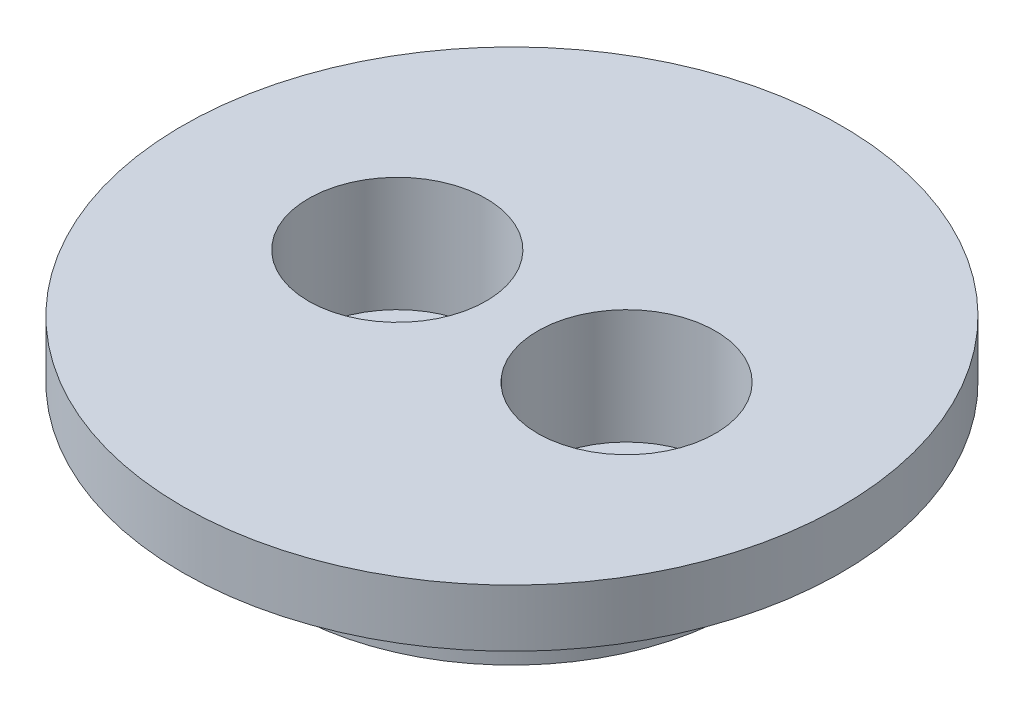
ISO-10303-21;
HEADER;
FILE_DESCRIPTION(('STEP AP214'),'2;1');
FILE_NAME('part.step','',(''),(''),'','','');
FILE_SCHEMA(('AUTOMOTIVE_DESIGN { 1 0 10303 214 1 1 1 1 }'));
ENDSEC;
DATA;
#1=APPLICATION_CONTEXT('core data for automotive mechanical design processes');
#2=APPLICATION_PROTOCOL_DEFINITION('international standard','automotive_design',2000,#1);
#3=PRODUCT_CONTEXT('',#1,'mechanical');
#4=PRODUCT('Part','Part','',(#3));
#5=PRODUCT_RELATED_PRODUCT_CATEGORY('part','',(#4));
#6=PRODUCT_DEFINITION_FORMATION('','',#4);
#7=PRODUCT_DEFINITION_CONTEXT('part definition',#1,'design');
#8=PRODUCT_DEFINITION('design','',#6,#7);
#9=PRODUCT_DEFINITION_SHAPE('','',#8);
#10=(LENGTH_UNIT() NAMED_UNIT(*) SI_UNIT(.MILLI.,.METRE.));
#11=(NAMED_UNIT(*) PLANE_ANGLE_UNIT() SI_UNIT($,.RADIAN.));
#12=(NAMED_UNIT(*) SI_UNIT($,.STERADIAN.) SOLID_ANGLE_UNIT());
#13=UNCERTAINTY_MEASURE_WITH_UNIT(LENGTH_MEASURE(1.E-05),#10,'distance_accuracy_value','');
#14=(GEOMETRIC_REPRESENTATION_CONTEXT(3) GLOBAL_UNCERTAINTY_ASSIGNED_CONTEXT((#13)) GLOBAL_UNIT_ASSIGNED_CONTEXT((#10,
#11,#12)) REPRESENTATION_CONTEXT('',''));
#15=CARTESIAN_POINT('',(0.,0.,0.));
#16=DIRECTION('',(0.,0.,1.));
#17=DIRECTION('',(1.,0.,0.));
#18=AXIS2_PLACEMENT_3D('',#15,#16,#17);
#19=CARTESIAN_POINT('',(-4.,38.,0.));
#20=DIRECTION('',(0.,-1.,0.));
#21=DIRECTION('',(0.,0.,-1.));
#22=AXIS2_PLACEMENT_3D('',#19,#20,#21);
#23=CYLINDRICAL_SURFACE('',#22,1.5);
#24=CARTESIAN_POINT('',(-4.,35.,0.));
#25=DIRECTION('',(0.,1.,0.));
#26=DIRECTION('',(0.,0.,1.));
#27=AXIS2_PLACEMENT_3D('',#24,#25,#26);
#28=CIRCLE('',#27,1.5);
#29=CARTESIAN_POINT('',(-4.,35.,1.5));
#30=VERTEX_POINT('',#29);
#31=EDGE_CURVE('E43',#30,#30,#28,.T.);
#32=ORIENTED_EDGE('',*,*,#31,.F.);
#33=EDGE_LOOP('',(#32));
#34=FACE_BOUND('',#33,.T.);
#35=CARTESIAN_POINT('',(-4.,36.,0.));
#36=DIRECTION('',(0.,1.,0.));
#37=DIRECTION('',(0.,0.,1.));
#38=AXIS2_PLACEMENT_3D('',#35,#36,#37);
#39=CIRCLE('',#38,1.5);
#40=CARTESIAN_POINT('',(-4.,36.,1.5));
#41=VERTEX_POINT('',#40);
#42=EDGE_CURVE('E34',#41,#41,#39,.T.);
#43=ORIENTED_EDGE('',*,*,#42,.T.);
#44=EDGE_LOOP('',(#43));
#45=FACE_BOUND('',#44,.T.);
#46=ADVANCED_FACE('F30',(#34,#45),#23,.F.);
#47=CARTESIAN_POINT('',(4.,38.,0.));
#48=DIRECTION('',(0.,-1.,0.));
#49=DIRECTION('',(0.,0.,-1.));
#50=AXIS2_PLACEMENT_3D('',#47,#48,#49);
#51=CYLINDRICAL_SURFACE('',#50,1.5);
#52=CARTESIAN_POINT('',(4.,35.,0.));
#53=DIRECTION('',(0.,1.,0.));
#54=DIRECTION('',(0.,0.,1.));
#55=AXIS2_PLACEMENT_3D('',#52,#53,#54);
#56=CIRCLE('',#55,1.5);
#57=CARTESIAN_POINT('',(4.,35.,1.5));
#58=VERTEX_POINT('',#57);
#59=EDGE_CURVE('E71',#58,#58,#56,.T.);
#60=ORIENTED_EDGE('',*,*,#59,.F.);
#61=EDGE_LOOP('',(#60));
#62=FACE_BOUND('',#61,.T.);
#63=CARTESIAN_POINT('',(4.,36.,0.));
#64=DIRECTION('',(0.,1.,0.));
#65=DIRECTION('',(0.,0.,1.));
#66=AXIS2_PLACEMENT_3D('',#63,#64,#65);
#67=CIRCLE('',#66,1.5);
#68=CARTESIAN_POINT('',(4.,36.,1.5));
#69=VERTEX_POINT('',#68);
#70=EDGE_CURVE('E47',#69,#69,#67,.T.);
#71=ORIENTED_EDGE('',*,*,#70,.T.);
#72=EDGE_LOOP('',(#71));
#73=FACE_BOUND('',#72,.T.);
#74=ADVANCED_FACE('F83',(#62,#73),#51,.F.);
#75=CARTESIAN_POINT('',(0.,35.,0.));
#76=DIRECTION('',(0.,1.,0.));
#77=DIRECTION('',(0.,0.,1.));
#78=AXIS2_PLACEMENT_3D('',#75,#76,#77);
#79=PLANE('',#78);
#80=CARTESIAN_POINT('',(0.,35.,0.));
#81=DIRECTION('',(0.,1.,0.));
#82=DIRECTION('',(0.,0.,1.));
#83=AXIS2_PLACEMENT_3D('',#80,#81,#82);
#84=CIRCLE('',#83,7.85);
#85=CARTESIAN_POINT('',(0.,35.,7.85));
#86=VERTEX_POINT('',#85);
#87=EDGE_CURVE('E38',#86,#86,#84,.T.);
#88=ORIENTED_EDGE('',*,*,#87,.F.);
#89=EDGE_LOOP('',(#88));
#90=FACE_BOUND('',#89,.T.);
#91=ORIENTED_EDGE('',*,*,#31,.T.);
#92=EDGE_LOOP('',(#91));
#93=FACE_BOUND('',#92,.T.);
#94=ORIENTED_EDGE('',*,*,#59,.T.);
#95=EDGE_LOOP('',(#94));
#96=FACE_BOUND('',#95,.T.);
#97=ADVANCED_FACE('F79',(#90,#93,#96),#79,.F.);
#98=CARTESIAN_POINT('',(0.,38.,0.));
#99=DIRECTION('',(0.,-1.,0.));
#100=DIRECTION('',(0.,0.,-1.));
#101=AXIS2_PLACEMENT_3D('',#98,#99,#100);
#102=CYLINDRICAL_SURFACE('',#101,7.85);
#103=CARTESIAN_POINT('',(0.,38.,0.));
#104=DIRECTION('',(0.,1.,0.));
#105=DIRECTION('',(0.,0.,1.));
#106=AXIS2_PLACEMENT_3D('',#103,#104,#105);
#107=CIRCLE('',#106,7.85);
#108=CARTESIAN_POINT('',(0.,38.,7.85));
#109=VERTEX_POINT('',#108);
#110=EDGE_CURVE('E10',#109,#109,#107,.T.);
#111=ORIENTED_EDGE('',*,*,#110,.F.);
#112=EDGE_LOOP('',(#111));
#113=FACE_BOUND('',#112,.T.);
#114=ORIENTED_EDGE('',*,*,#87,.T.);
#115=EDGE_LOOP('',(#114));
#116=FACE_BOUND('',#115,.T.);
#117=ADVANCED_FACE('F32',(#113,#116),#102,.T.);
#118=CARTESIAN_POINT('',(0.,40.,0.));
#119=DIRECTION('',(0.,1.,0.));
#120=DIRECTION('',(0.,0.,1.));
#121=AXIS2_PLACEMENT_3D('',#118,#119,#120);
#122=PLANE('',#121);
#123=CARTESIAN_POINT('',(-4.,40.,0.));
#124=DIRECTION('',(0.,1.,0.));
#125=DIRECTION('',(0.,0.,1.));
#126=AXIS2_PLACEMENT_3D('',#123,#124,#125);
#127=CIRCLE('',#126,3.1);
#128=CARTESIAN_POINT('',(-4.,40.,3.1));
#129=VERTEX_POINT('',#128);
#130=EDGE_CURVE('E55',#129,#129,#127,.T.);
#131=ORIENTED_EDGE('',*,*,#130,.F.);
#132=EDGE_LOOP('',(#131));
#133=FACE_BOUND('',#132,.T.);
#134=CARTESIAN_POINT('',(4.,40.,0.));
#135=DIRECTION('',(0.,1.,0.));
#136=DIRECTION('',(0.,0.,1.));
#137=AXIS2_PLACEMENT_3D('',#134,#135,#136);
#138=CIRCLE('',#137,3.1);
#139=CARTESIAN_POINT('',(4.,40.,3.1));
#140=VERTEX_POINT('',#139);
#141=EDGE_CURVE('E65',#140,#140,#138,.T.);
#142=ORIENTED_EDGE('',*,*,#141,.F.);
#143=EDGE_LOOP('',(#142));
#144=FACE_BOUND('',#143,.T.);
#145=CARTESIAN_POINT('',(0.,40.,0.));
#146=DIRECTION('',(0.,1.,0.));
#147=DIRECTION('',(0.,0.,1.));
#148=AXIS2_PLACEMENT_3D('',#145,#146,#147);
#149=CIRCLE('',#148,11.5);
#150=CARTESIAN_POINT('',(0.,40.,11.5));
#151=VERTEX_POINT('',#150);
#152=EDGE_CURVE('E68',#151,#151,#149,.T.);
#153=ORIENTED_EDGE('',*,*,#152,.T.);
#154=EDGE_LOOP('',(#153));
#155=FACE_BOUND('',#154,.T.);
#156=ADVANCED_FACE('F106',(#133,#144,#155),#122,.T.);
#157=CARTESIAN_POINT('',(0.,38.,0.));
#158=DIRECTION('',(0.,1.,0.));
#159=DIRECTION('',(0.,0.,1.));
#160=AXIS2_PLACEMENT_3D('',#157,#158,#159);
#161=PLANE('',#160);
#162=ORIENTED_EDGE('',*,*,#110,.T.);
#163=EDGE_LOOP('',(#162));
#164=FACE_BOUND('',#163,.T.);
#165=CARTESIAN_POINT('',(0.,38.,0.));
#166=DIRECTION('',(0.,1.,0.));
#167=DIRECTION('',(0.,0.,1.));
#168=AXIS2_PLACEMENT_3D('',#165,#166,#167);
#169=CIRCLE('',#168,11.5);
#170=CARTESIAN_POINT('',(0.,38.,11.5));
#171=VERTEX_POINT('',#170);
#172=EDGE_CURVE('E53',#171,#171,#169,.T.);
#173=ORIENTED_EDGE('',*,*,#172,.F.);
#174=EDGE_LOOP('',(#173));
#175=FACE_BOUND('',#174,.T.);
#176=ADVANCED_FACE('F109',(#164,#175),#161,.F.);
#177=CARTESIAN_POINT('',(0.,40.,0.));
#178=DIRECTION('',(0.,-1.,0.));
#179=DIRECTION('',(0.,0.,-1.));
#180=AXIS2_PLACEMENT_3D('',#177,#178,#179);
#181=CYLINDRICAL_SURFACE('',#180,11.5);
#182=ORIENTED_EDGE('',*,*,#152,.F.);
#183=EDGE_LOOP('',(#182));
#184=FACE_BOUND('',#183,.T.);
#185=ORIENTED_EDGE('',*,*,#172,.T.);
#186=EDGE_LOOP('',(#185));
#187=FACE_BOUND('',#186,.T.);
#188=ADVANCED_FACE('F104',(#184,#187),#181,.T.);
#189=CARTESIAN_POINT('',(4.,36.,0.));
#190=DIRECTION('',(0.,1.,0.));
#191=DIRECTION('',(0.,0.,1.));
#192=AXIS2_PLACEMENT_3D('',#189,#190,#191);
#193=CYLINDRICAL_SURFACE('',#192,3.1);
#194=CARTESIAN_POINT('',(4.,36.,0.));
#195=DIRECTION('',(0.,1.,0.));
#196=DIRECTION('',(0.,0.,1.));
#197=AXIS2_PLACEMENT_3D('',#194,#195,#196);
#198=CIRCLE('',#197,3.1);
#199=CARTESIAN_POINT('',(4.,36.,3.1));
#200=VERTEX_POINT('',#199);
#201=EDGE_CURVE('E60',#200,#200,#198,.T.);
#202=ORIENTED_EDGE('',*,*,#201,.F.);
#203=EDGE_LOOP('',(#202));
#204=FACE_BOUND('',#203,.T.);
#205=ORIENTED_EDGE('',*,*,#141,.T.);
#206=EDGE_LOOP('',(#205));
#207=FACE_BOUND('',#206,.T.);
#208=ADVANCED_FACE('F100',(#204,#207),#193,.F.);
#209=CARTESIAN_POINT('',(4.,36.,0.));
#210=DIRECTION('',(0.,1.,0.));
#211=DIRECTION('',(0.,0.,1.));
#212=AXIS2_PLACEMENT_3D('',#209,#210,#211);
#213=PLANE('',#212);
#214=ORIENTED_EDGE('',*,*,#70,.F.);
#215=EDGE_LOOP('',(#214));
#216=FACE_BOUND('',#215,.T.);
#217=ORIENTED_EDGE('',*,*,#201,.T.);
#218=EDGE_LOOP('',(#217));
#219=FACE_BOUND('',#218,.T.);
#220=ADVANCED_FACE('F94',(#216,#219),#213,.T.);
#221=CARTESIAN_POINT('',(-4.,36.,0.));
#222=DIRECTION('',(0.,1.,0.));
#223=DIRECTION('',(0.,0.,1.));
#224=AXIS2_PLACEMENT_3D('',#221,#222,#223);
#225=CYLINDRICAL_SURFACE('',#224,3.1);
#226=CARTESIAN_POINT('',(-4.,36.,0.));
#227=DIRECTION('',(0.,1.,0.));
#228=DIRECTION('',(0.,0.,1.));
#229=AXIS2_PLACEMENT_3D('',#226,#227,#228);
#230=CIRCLE('',#229,3.1);
#231=CARTESIAN_POINT('',(-4.,36.,3.1));
#232=VERTEX_POINT('',#231);
#233=EDGE_CURVE('E49',#232,#232,#230,.T.);
#234=ORIENTED_EDGE('',*,*,#233,.F.);
#235=EDGE_LOOP('',(#234));
#236=FACE_BOUND('',#235,.T.);
#237=ORIENTED_EDGE('',*,*,#130,.T.);
#238=EDGE_LOOP('',(#237));
#239=FACE_BOUND('',#238,.T.);
#240=ADVANCED_FACE('F89',(#236,#239),#225,.F.);
#241=CARTESIAN_POINT('',(-4.,36.,0.));
#242=DIRECTION('',(0.,1.,0.));
#243=DIRECTION('',(0.,0.,1.));
#244=AXIS2_PLACEMENT_3D('',#241,#242,#243);
#245=PLANE('',#244);
#246=ORIENTED_EDGE('',*,*,#42,.F.);
#247=EDGE_LOOP('',(#246));
#248=FACE_BOUND('',#247,.T.);
#249=ORIENTED_EDGE('',*,*,#233,.T.);
#250=EDGE_LOOP('',(#249));
#251=FACE_BOUND('',#250,.T.);
#252=ADVANCED_FACE('F87',(#248,#251),#245,.T.);
#253=CLOSED_SHELL('',(#46,#74,#97,#117,#156,#176,#188,#208,#220,#240,#252));
#254=MANIFOLD_SOLID_BREP('B2',#253);
#255=ADVANCED_BREP_SHAPE_REPRESENTATION('',(#18,#254),#14);
#256=SHAPE_DEFINITION_REPRESENTATION(#9,#255);
ENDSEC;
END-ISO-10303-21;
